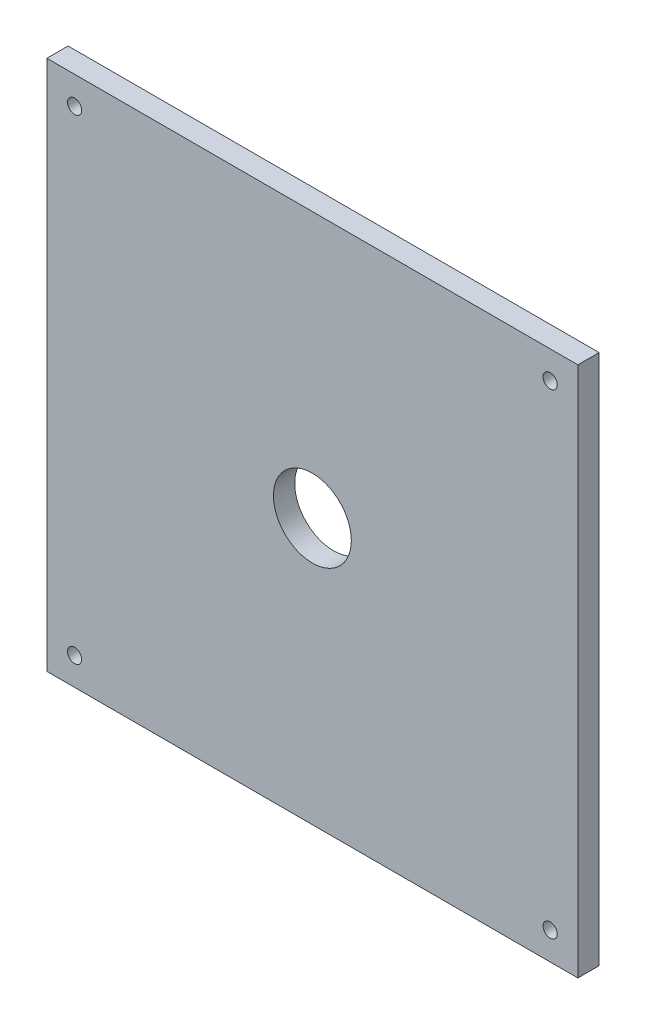
ISO-10303-21;
HEADER;
FILE_DESCRIPTION(('STEP AP214'),'2;1');
FILE_NAME('part.step','',(''),(''),'','','');
FILE_SCHEMA(('AUTOMOTIVE_DESIGN { 1 0 10303 214 1 1 1 1 }'));
ENDSEC;
DATA;
#1=APPLICATION_CONTEXT('core data for automotive mechanical design processes');
#2=APPLICATION_PROTOCOL_DEFINITION('international standard','automotive_design',2000,#1);
#3=PRODUCT_CONTEXT('',#1,'mechanical');
#4=PRODUCT('Part','Part','',(#3));
#5=PRODUCT_RELATED_PRODUCT_CATEGORY('part','',(#4));
#6=PRODUCT_DEFINITION_FORMATION('','',#4);
#7=PRODUCT_DEFINITION_CONTEXT('part definition',#1,'design');
#8=PRODUCT_DEFINITION('design','',#6,#7);
#9=PRODUCT_DEFINITION_SHAPE('','',#8);
#10=(LENGTH_UNIT() NAMED_UNIT(*) SI_UNIT(.MILLI.,.METRE.));
#11=(NAMED_UNIT(*) PLANE_ANGLE_UNIT() SI_UNIT($,.RADIAN.));
#12=(NAMED_UNIT(*) SI_UNIT($,.STERADIAN.) SOLID_ANGLE_UNIT());
#13=UNCERTAINTY_MEASURE_WITH_UNIT(LENGTH_MEASURE(1.E-05),#10,'distance_accuracy_value','');
#14=(GEOMETRIC_REPRESENTATION_CONTEXT(3) GLOBAL_UNCERTAINTY_ASSIGNED_CONTEXT((#13)) GLOBAL_UNIT_ASSIGNED_CONTEXT((#10,
#11,#12)) REPRESENTATION_CONTEXT('',''));
#15=CARTESIAN_POINT('',(0.,0.,0.));
#16=DIRECTION('',(0.,0.,1.));
#17=DIRECTION('',(1.,0.,0.));
#18=AXIS2_PLACEMENT_3D('',#15,#16,#17);
#19=CARTESIAN_POINT('',(0.,-75.,6.));
#20=DIRECTION('',(0.,1.,0.));
#21=DIRECTION('',(0.,0.,1.));
#22=AXIS2_PLACEMENT_3D('',#19,#20,#21);
#23=PLANE('',#22);
#24=DIRECTION('',(1.,0.,0.));
#25=VECTOR('',#24,1.);
#26=CARTESIAN_POINT('',(0.,-75.,0.));
#27=LINE('',#26,#25);
#28=CARTESIAN_POINT('',(-75.,-75.,0.));
#29=VERTEX_POINT('',#28);
#30=CARTESIAN_POINT('',(75.,-75.,0.));
#31=VERTEX_POINT('',#30);
#32=EDGE_CURVE('E108',#29,#31,#27,.T.);
#33=ORIENTED_EDGE('',*,*,#32,.T.);
#34=DIRECTION('',(0.,0.,-1.));
#35=VECTOR('',#34,1.);
#36=CARTESIAN_POINT('',(75.,-75.,6.));
#37=LINE('',#36,#35);
#38=CARTESIAN_POINT('',(75.,-75.,6.));
#39=VERTEX_POINT('',#38);
#40=EDGE_CURVE('E11',#39,#31,#37,.T.);
#41=ORIENTED_EDGE('',*,*,#40,.F.);
#42=DIRECTION('',(1.,0.,0.));
#43=VECTOR('',#42,1.);
#44=CARTESIAN_POINT('',(0.,-75.,6.));
#45=LINE('',#44,#43);
#46=CARTESIAN_POINT('',(-75.,-75.,6.));
#47=VERTEX_POINT('',#46);
#48=EDGE_CURVE('E90',#47,#39,#45,.T.);
#49=ORIENTED_EDGE('',*,*,#48,.F.);
#50=DIRECTION('',(0.,0.,-1.));
#51=VECTOR('',#50,1.);
#52=CARTESIAN_POINT('',(-75.,-75.,6.));
#53=LINE('',#52,#51);
#54=EDGE_CURVE('E57',#47,#29,#53,.T.);
#55=ORIENTED_EDGE('',*,*,#54,.T.);
#56=EDGE_LOOP('',(#33,#41,#49,#55));
#57=FACE_BOUND('',#56,.T.);
#58=ADVANCED_FACE('F38',(#57),#23,.F.);
#59=CARTESIAN_POINT('',(75.,0.,6.));
#60=DIRECTION('',(-1.,0.,0.));
#61=DIRECTION('',(0.,0.,1.));
#62=AXIS2_PLACEMENT_3D('',#59,#60,#61);
#63=PLANE('',#62);
#64=DIRECTION('',(0.,1.,0.));
#65=VECTOR('',#64,1.);
#66=CARTESIAN_POINT('',(75.,0.,0.));
#67=LINE('',#66,#65);
#68=CARTESIAN_POINT('',(75.,75.,0.));
#69=VERTEX_POINT('',#68);
#70=EDGE_CURVE('E95',#31,#69,#67,.T.);
#71=ORIENTED_EDGE('',*,*,#70,.T.);
#72=DIRECTION('',(0.,0.,-1.));
#73=VECTOR('',#72,1.);
#74=CARTESIAN_POINT('',(75.,75.,6.));
#75=LINE('',#74,#73);
#76=CARTESIAN_POINT('',(75.,75.,6.));
#77=VERTEX_POINT('',#76);
#78=EDGE_CURVE('E48',#77,#69,#75,.T.);
#79=ORIENTED_EDGE('',*,*,#78,.F.);
#80=DIRECTION('',(0.,1.,0.));
#81=VECTOR('',#80,1.);
#82=CARTESIAN_POINT('',(75.,0.,6.));
#83=LINE('',#82,#81);
#84=EDGE_CURVE('E82',#39,#77,#83,.T.);
#85=ORIENTED_EDGE('',*,*,#84,.F.);
#86=ORIENTED_EDGE('',*,*,#40,.T.);
#87=EDGE_LOOP('',(#71,#79,#85,#86));
#88=FACE_BOUND('',#87,.T.);
#89=ADVANCED_FACE('F94',(#88),#63,.F.);
#90=CARTESIAN_POINT('',(0.,75.,6.));
#91=DIRECTION('',(0.,1.,0.));
#92=DIRECTION('',(0.,0.,1.));
#93=AXIS2_PLACEMENT_3D('',#90,#91,#92);
#94=PLANE('',#93);
#95=DIRECTION('',(1.,0.,0.));
#96=VECTOR('',#95,1.);
#97=CARTESIAN_POINT('',(0.,75.,0.));
#98=LINE('',#97,#96);
#99=CARTESIAN_POINT('',(-75.,75.,0.));
#100=VERTEX_POINT('',#99);
#101=EDGE_CURVE('E111',#100,#69,#98,.T.);
#102=ORIENTED_EDGE('',*,*,#101,.F.);
#103=DIRECTION('',(0.,0.,-1.));
#104=VECTOR('',#103,1.);
#105=CARTESIAN_POINT('',(-75.,75.,6.));
#106=LINE('',#105,#104);
#107=CARTESIAN_POINT('',(-75.,75.,6.));
#108=VERTEX_POINT('',#107);
#109=EDGE_CURVE('E71',#108,#100,#106,.T.);
#110=ORIENTED_EDGE('',*,*,#109,.F.);
#111=DIRECTION('',(1.,0.,0.));
#112=VECTOR('',#111,1.);
#113=CARTESIAN_POINT('',(0.,75.,6.));
#114=LINE('',#113,#112);
#115=EDGE_CURVE('E89',#108,#77,#114,.T.);
#116=ORIENTED_EDGE('',*,*,#115,.T.);
#117=ORIENTED_EDGE('',*,*,#78,.T.);
#118=EDGE_LOOP('',(#102,#110,#116,#117));
#119=FACE_BOUND('',#118,.T.);
#120=ADVANCED_FACE('F99',(#119),#94,.T.);
#121=CARTESIAN_POINT('',(0.,0.,6.));
#122=DIRECTION('',(0.,0.,-1.));
#123=DIRECTION('',(-1.,0.,0.));
#124=AXIS2_PLACEMENT_3D('',#121,#122,#123);
#125=CYLINDRICAL_SURFACE('',#124,11.);
#126=CARTESIAN_POINT('',(0.,0.,6.));
#127=DIRECTION('',(0.,0.,1.));
#128=DIRECTION('',(1.,0.,0.));
#129=AXIS2_PLACEMENT_3D('',#126,#127,#128);
#130=CIRCLE('',#129,11.);
#131=CARTESIAN_POINT('',(11.,0.,6.));
#132=VERTEX_POINT('',#131);
#133=EDGE_CURVE('E116',#132,#132,#130,.T.);
#134=ORIENTED_EDGE('',*,*,#133,.T.);
#135=EDGE_LOOP('',(#134));
#136=FACE_BOUND('',#135,.T.);
#137=CARTESIAN_POINT('',(0.,0.,0.));
#138=DIRECTION('',(0.,0.,1.));
#139=DIRECTION('',(1.,0.,0.));
#140=AXIS2_PLACEMENT_3D('',#137,#138,#139);
#141=CIRCLE('',#140,11.);
#142=CARTESIAN_POINT('',(11.,0.,0.));
#143=VERTEX_POINT('',#142);
#144=EDGE_CURVE('E105',#143,#143,#141,.T.);
#145=ORIENTED_EDGE('',*,*,#144,.F.);
#146=EDGE_LOOP('',(#145));
#147=FACE_BOUND('',#146,.T.);
#148=ADVANCED_FACE('F40',(#136,#147),#125,.F.);
#149=CARTESIAN_POINT('',(-75.,0.,6.));
#150=DIRECTION('',(-1.,0.,0.));
#151=DIRECTION('',(0.,0.,1.));
#152=AXIS2_PLACEMENT_3D('',#149,#150,#151);
#153=PLANE('',#152);
#154=DIRECTION('',(0.,1.,0.));
#155=VECTOR('',#154,1.);
#156=CARTESIAN_POINT('',(-75.,0.,0.));
#157=LINE('',#156,#155);
#158=EDGE_CURVE('E113',#29,#100,#157,.T.);
#159=ORIENTED_EDGE('',*,*,#158,.F.);
#160=ORIENTED_EDGE('',*,*,#54,.F.);
#161=DIRECTION('',(0.,1.,0.));
#162=VECTOR('',#161,1.);
#163=CARTESIAN_POINT('',(-75.,0.,6.));
#164=LINE('',#163,#162);
#165=EDGE_CURVE('E100',#47,#108,#164,.T.);
#166=ORIENTED_EDGE('',*,*,#165,.T.);
#167=ORIENTED_EDGE('',*,*,#109,.T.);
#168=EDGE_LOOP('',(#159,#160,#166,#167));
#169=FACE_BOUND('',#168,.T.);
#170=ADVANCED_FACE('F155',(#169),#153,.T.);
#171=CARTESIAN_POINT('',(0.,0.,6.));
#172=DIRECTION('',(0.,0.,1.));
#173=DIRECTION('',(1.,0.,0.));
#174=AXIS2_PLACEMENT_3D('',#171,#172,#173);
#175=PLANE('',#174);
#176=CARTESIAN_POINT('',(-67.1751442127221,67.1751442126973,6.));
#177=DIRECTION('',(0.,0.,1.));
#178=DIRECTION('',(1.,0.,0.));
#179=AXIS2_PLACEMENT_3D('',#176,#177,#178);
#180=CIRCLE('',#179,2.00000000002405);
#181=CARTESIAN_POINT('',(-65.175144212698,67.1751442126973,6.));
#182=VERTEX_POINT('',#181);
#183=EDGE_CURVE('E183',#182,#182,#180,.T.);
#184=ORIENTED_EDGE('',*,*,#183,.F.);
#185=EDGE_LOOP('',(#184));
#186=FACE_BOUND('',#185,.T.);
#187=CARTESIAN_POINT('',(-67.1751442126974,-67.1751442127467,6.));
#188=DIRECTION('',(0.,0.,1.));
#189=DIRECTION('',(1.,0.,0.));
#190=AXIS2_PLACEMENT_3D('',#187,#188,#189);
#191=CIRCLE('',#190,2.00000000001663);
#192=CARTESIAN_POINT('',(-65.1751442126808,-67.1751442127467,6.));
#193=VERTEX_POINT('',#192);
#194=EDGE_CURVE('E185',#193,#193,#191,.T.);
#195=ORIENTED_EDGE('',*,*,#194,.F.);
#196=EDGE_LOOP('',(#195));
#197=FACE_BOUND('',#196,.T.);
#198=CARTESIAN_POINT('',(67.1751442127467,-67.1751442127221,6.));
#199=DIRECTION('',(0.,0.,1.));
#200=DIRECTION('',(1.,0.,0.));
#201=AXIS2_PLACEMENT_3D('',#198,#199,#200);
#202=CIRCLE('',#201,1.99999999999289);
#203=CARTESIAN_POINT('',(69.1751442127396,-67.1751442127221,6.));
#204=VERTEX_POINT('',#203);
#205=EDGE_CURVE('E182',#204,#204,#202,.T.);
#206=ORIENTED_EDGE('',*,*,#205,.F.);
#207=EDGE_LOOP('',(#206));
#208=FACE_BOUND('',#207,.T.);
#209=CARTESIAN_POINT('',(67.175144212722,67.175144212722,6.));
#210=DIRECTION('',(0.,0.,1.));
#211=DIRECTION('',(1.,0.,0.));
#212=AXIS2_PLACEMENT_3D('',#209,#210,#211);
#213=CIRCLE('',#212,2.);
#214=CARTESIAN_POINT('',(69.175144212722,67.175144212722,6.));
#215=VERTEX_POINT('',#214);
#216=EDGE_CURVE('E123',#215,#215,#213,.T.);
#217=ORIENTED_EDGE('',*,*,#216,.F.);
#218=EDGE_LOOP('',(#217));
#219=FACE_BOUND('',#218,.T.);
#220=ORIENTED_EDGE('',*,*,#133,.F.);
#221=EDGE_LOOP('',(#220));
#222=FACE_BOUND('',#221,.T.);
#223=ORIENTED_EDGE('',*,*,#48,.T.);
#224=ORIENTED_EDGE('',*,*,#84,.T.);
#225=ORIENTED_EDGE('',*,*,#115,.F.);
#226=ORIENTED_EDGE('',*,*,#165,.F.);
#227=EDGE_LOOP('',(#223,#224,#225,#226));
#228=FACE_BOUND('',#227,.T.);
#229=ADVANCED_FACE('F86',(#186,#197,#208,#219,#222,#228),#175,.T.);
#230=CARTESIAN_POINT('',(0.,0.,0.));
#231=DIRECTION('',(0.,0.,1.));
#232=DIRECTION('',(1.,0.,0.));
#233=AXIS2_PLACEMENT_3D('',#230,#231,#232);
#234=PLANE('',#233);
#235=CARTESIAN_POINT('',(-67.1751442127221,67.1751442126973,0.));
#236=DIRECTION('',(0.,0.,1.));
#237=DIRECTION('',(1.,0.,0.));
#238=AXIS2_PLACEMENT_3D('',#235,#236,#237);
#239=CIRCLE('',#238,2.00000000002405);
#240=CARTESIAN_POINT('',(-65.175144212698,67.1751442126973,0.));
#241=VERTEX_POINT('',#240);
#242=EDGE_CURVE('E42',#241,#241,#239,.T.);
#243=ORIENTED_EDGE('',*,*,#242,.T.);
#244=EDGE_LOOP('',(#243));
#245=FACE_BOUND('',#244,.T.);
#246=CARTESIAN_POINT('',(-67.1751442126974,-67.1751442127467,0.));
#247=DIRECTION('',(0.,0.,1.));
#248=DIRECTION('',(1.,0.,0.));
#249=AXIS2_PLACEMENT_3D('',#246,#247,#248);
#250=CIRCLE('',#249,2.00000000001663);
#251=CARTESIAN_POINT('',(-65.1751442126808,-67.1751442127467,0.));
#252=VERTEX_POINT('',#251);
#253=EDGE_CURVE('E125',#252,#252,#250,.T.);
#254=ORIENTED_EDGE('',*,*,#253,.T.);
#255=EDGE_LOOP('',(#254));
#256=FACE_BOUND('',#255,.T.);
#257=CARTESIAN_POINT('',(67.1751442127467,-67.1751442127221,0.));
#258=DIRECTION('',(0.,0.,1.));
#259=DIRECTION('',(1.,0.,0.));
#260=AXIS2_PLACEMENT_3D('',#257,#258,#259);
#261=CIRCLE('',#260,1.99999999999289);
#262=CARTESIAN_POINT('',(69.1751442127396,-67.1751442127221,0.));
#263=VERTEX_POINT('',#262);
#264=EDGE_CURVE('E122',#263,#263,#261,.T.);
#265=ORIENTED_EDGE('',*,*,#264,.T.);
#266=EDGE_LOOP('',(#265));
#267=FACE_BOUND('',#266,.T.);
#268=CARTESIAN_POINT('',(67.175144212722,67.175144212722,0.));
#269=DIRECTION('',(0.,0.,1.));
#270=DIRECTION('',(1.,0.,0.));
#271=AXIS2_PLACEMENT_3D('',#268,#269,#270);
#272=CIRCLE('',#271,2.);
#273=CARTESIAN_POINT('',(69.175144212722,67.175144212722,0.));
#274=VERTEX_POINT('',#273);
#275=EDGE_CURVE('E119',#274,#274,#272,.T.);
#276=ORIENTED_EDGE('',*,*,#275,.T.);
#277=EDGE_LOOP('',(#276));
#278=FACE_BOUND('',#277,.T.);
#279=ORIENTED_EDGE('',*,*,#144,.T.);
#280=EDGE_LOOP('',(#279));
#281=FACE_BOUND('',#280,.T.);
#282=ORIENTED_EDGE('',*,*,#32,.F.);
#283=ORIENTED_EDGE('',*,*,#158,.T.);
#284=ORIENTED_EDGE('',*,*,#101,.T.);
#285=ORIENTED_EDGE('',*,*,#70,.F.);
#286=EDGE_LOOP('',(#282,#283,#284,#285));
#287=FACE_BOUND('',#286,.T.);
#288=ADVANCED_FACE('F132',(#245,#256,#267,#278,#281,#287),#234,.F.);
#289=CARTESIAN_POINT('',(67.175144212722,67.175144212722,-4.));
#290=DIRECTION('',(0.,0.,1.));
#291=DIRECTION('',(1.,0.,0.));
#292=AXIS2_PLACEMENT_3D('',#289,#290,#291);
#293=CYLINDRICAL_SURFACE('',#292,2.);
#294=ORIENTED_EDGE('',*,*,#216,.T.);
#295=EDGE_LOOP('',(#294));
#296=FACE_BOUND('',#295,.T.);
#297=ORIENTED_EDGE('',*,*,#275,.F.);
#298=EDGE_LOOP('',(#297));
#299=FACE_BOUND('',#298,.T.);
#300=ADVANCED_FACE('F160',(#296,#299),#293,.F.);
#301=CARTESIAN_POINT('',(67.1751442127467,-67.1751442127221,-4.));
#302=DIRECTION('',(0.,0.,1.));
#303=DIRECTION('',(1.,0.,0.));
#304=AXIS2_PLACEMENT_3D('',#301,#302,#303);
#305=CYLINDRICAL_SURFACE('',#304,1.99999999999289);
#306=ORIENTED_EDGE('',*,*,#205,.T.);
#307=EDGE_LOOP('',(#306));
#308=FACE_BOUND('',#307,.T.);
#309=ORIENTED_EDGE('',*,*,#264,.F.);
#310=EDGE_LOOP('',(#309));
#311=FACE_BOUND('',#310,.T.);
#312=ADVANCED_FACE('F142',(#308,#311),#305,.F.);
#313=CARTESIAN_POINT('',(-67.1751442126974,-67.1751442127467,-4.));
#314=DIRECTION('',(0.,0.,1.));
#315=DIRECTION('',(1.,0.,0.));
#316=AXIS2_PLACEMENT_3D('',#313,#314,#315);
#317=CYLINDRICAL_SURFACE('',#316,2.00000000001663);
#318=ORIENTED_EDGE('',*,*,#194,.T.);
#319=EDGE_LOOP('',(#318));
#320=FACE_BOUND('',#319,.T.);
#321=ORIENTED_EDGE('',*,*,#253,.F.);
#322=EDGE_LOOP('',(#321));
#323=FACE_BOUND('',#322,.T.);
#324=ADVANCED_FACE('F136',(#320,#323),#317,.F.);
#325=CARTESIAN_POINT('',(-67.1751442127221,67.1751442126973,-4.));
#326=DIRECTION('',(0.,0.,1.));
#327=DIRECTION('',(1.,0.,0.));
#328=AXIS2_PLACEMENT_3D('',#325,#326,#327);
#329=CYLINDRICAL_SURFACE('',#328,2.00000000002405);
#330=ORIENTED_EDGE('',*,*,#183,.T.);
#331=EDGE_LOOP('',(#330));
#332=FACE_BOUND('',#331,.T.);
#333=ORIENTED_EDGE('',*,*,#242,.F.);
#334=EDGE_LOOP('',(#333));
#335=FACE_BOUND('',#334,.T.);
#336=ADVANCED_FACE('F134',(#332,#335),#329,.F.);
#337=CLOSED_SHELL('',(#58,#89,#120,#148,#170,#229,#288,#300,#312,#324,#336));
#338=MANIFOLD_SOLID_BREP('B2',#337);
#339=ADVANCED_BREP_SHAPE_REPRESENTATION('',(#18,#338),#14);
#340=SHAPE_DEFINITION_REPRESENTATION(#9,#339);
ENDSEC;
END-ISO-10303-21;
